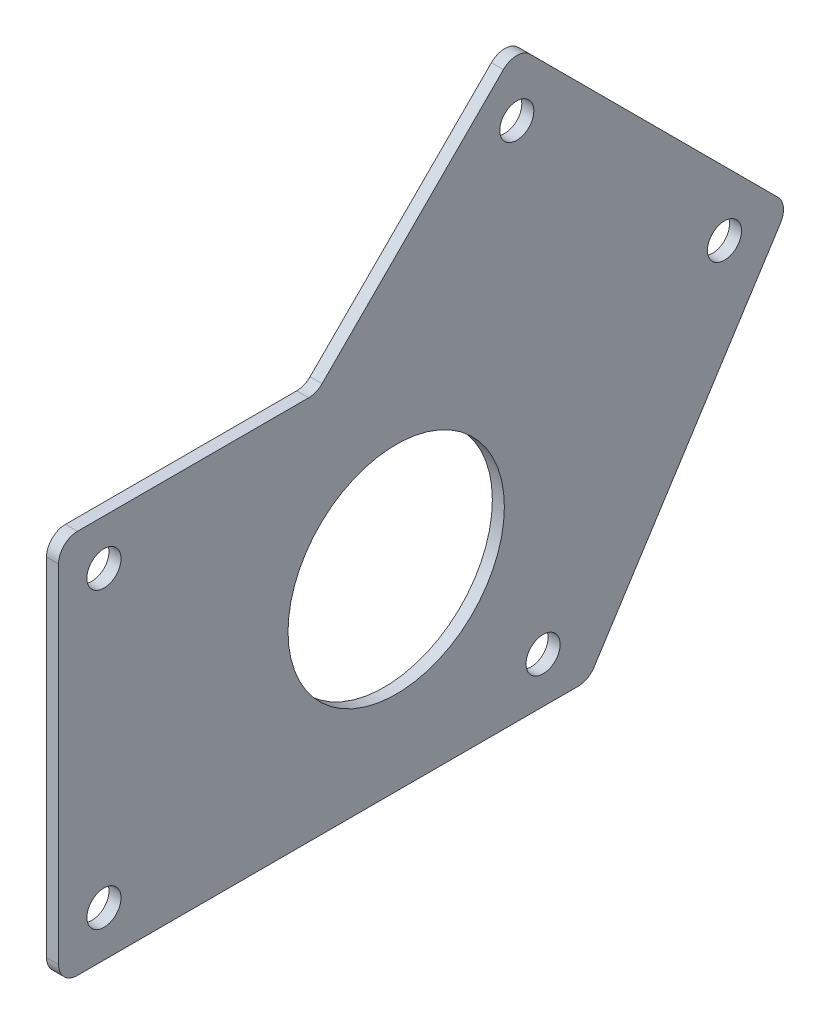
ISO-10303-21;
HEADER;
FILE_DESCRIPTION(('STEP AP214'),'2;1');
FILE_NAME('part.step','',(''),(''),'','','');
FILE_SCHEMA(('AUTOMOTIVE_DESIGN { 1 0 10303 214 1 1 1 1 }'));
ENDSEC;
DATA;
#1=APPLICATION_CONTEXT('core data for automotive mechanical design processes');
#2=APPLICATION_PROTOCOL_DEFINITION('international standard','automotive_design',2000,#1);
#3=PRODUCT_CONTEXT('',#1,'mechanical');
#4=PRODUCT('Part','Part','',(#3));
#5=PRODUCT_RELATED_PRODUCT_CATEGORY('part','',(#4));
#6=PRODUCT_DEFINITION_FORMATION('','',#4);
#7=PRODUCT_DEFINITION_CONTEXT('part definition',#1,'design');
#8=PRODUCT_DEFINITION('design','',#6,#7);
#9=PRODUCT_DEFINITION_SHAPE('','',#8);
#10=(LENGTH_UNIT() NAMED_UNIT(*) SI_UNIT(.MILLI.,.METRE.));
#11=(NAMED_UNIT(*) PLANE_ANGLE_UNIT() SI_UNIT($,.RADIAN.));
#12=(NAMED_UNIT(*) SI_UNIT($,.STERADIAN.) SOLID_ANGLE_UNIT());
#13=UNCERTAINTY_MEASURE_WITH_UNIT(LENGTH_MEASURE(1.E-05),#10,'distance_accuracy_value','');
#14=(GEOMETRIC_REPRESENTATION_CONTEXT(3) GLOBAL_UNCERTAINTY_ASSIGNED_CONTEXT((#13)) GLOBAL_UNIT_ASSIGNED_CONTEXT((#10,
#11,#12)) REPRESENTATION_CONTEXT('',''));
#15=CARTESIAN_POINT('',(0.,0.,0.));
#16=DIRECTION('',(0.,0.,1.));
#17=DIRECTION('',(1.,0.,0.));
#18=AXIS2_PLACEMENT_3D('',#15,#16,#17);
#19=CARTESIAN_POINT('',(103.1875,27.9,-117.643441609791));
#20=DIRECTION('',(-1.,0.,0.));
#21=DIRECTION('',(0.,0.,1.));
#22=AXIS2_PLACEMENT_3D('',#19,#20,#21);
#23=CYLINDRICAL_SURFACE('',#22,2.5);
#24=CARTESIAN_POINT('',(101.6,27.9,-117.643441609791));
#25=DIRECTION('',(1.,0.,0.));
#26=DIRECTION('',(0.,0.,-1.));
#27=AXIS2_PLACEMENT_3D('',#24,#25,#26);
#28=CIRCLE('',#27,2.5);
#29=CARTESIAN_POINT('',(101.6,25.4,-117.643441609791));
#30=VERTEX_POINT('',#29);
#31=CARTESIAN_POINT('',(101.6,26.1322330470337,-119.411208562757));
#32=VERTEX_POINT('',#31);
#33=EDGE_CURVE('E177',#30,#32,#28,.T.);
#34=ORIENTED_EDGE('',*,*,#33,.F.);
#35=DIRECTION('',(-1.,0.,0.));
#36=VECTOR('',#35,1.);
#37=CARTESIAN_POINT('',(103.1875,25.4,-117.643441609791));
#38=LINE('',#37,#36);
#39=CARTESIAN_POINT('',(103.1875,25.4,-117.643441609791));
#40=VERTEX_POINT('',#39);
#41=EDGE_CURVE('E11',#40,#30,#38,.T.);
#42=ORIENTED_EDGE('',*,*,#41,.F.);
#43=CARTESIAN_POINT('',(103.1875,27.9,-117.643441609791));
#44=DIRECTION('',(1.,0.,0.));
#45=DIRECTION('',(0.,0.,-1.));
#46=AXIS2_PLACEMENT_3D('',#43,#44,#45);
#47=CIRCLE('',#46,2.5);
#48=CARTESIAN_POINT('',(103.1875,26.1322330470337,-119.411208562757));
#49=VERTEX_POINT('',#48);
#50=EDGE_CURVE('E226',#40,#49,#47,.T.);
#51=ORIENTED_EDGE('',*,*,#50,.T.);
#52=DIRECTION('',(-1.,0.,0.));
#53=VECTOR('',#52,1.);
#54=CARTESIAN_POINT('',(103.1875,26.1322330470337,-119.411208562757));
#55=LINE('',#54,#53);
#56=EDGE_CURVE('E56',#49,#32,#55,.T.);
#57=ORIENTED_EDGE('',*,*,#56,.T.);
#58=EDGE_LOOP('',(#34,#42,#51,#57));
#59=FACE_BOUND('',#58,.T.);
#60=ADVANCED_FACE('F40',(#59),#23,.F.);
#61=CARTESIAN_POINT('',(103.1875,25.4,0.));
#62=DIRECTION('',(0.,-1.,0.));
#63=DIRECTION('',(0.,0.,-1.));
#64=AXIS2_PLACEMENT_3D('',#61,#62,#63);
#65=PLANE('',#64);
#66=DIRECTION('',(0.,0.,1.));
#67=VECTOR('',#66,1.);
#68=CARTESIAN_POINT('',(101.6,25.4,0.));
#69=LINE('',#68,#67);
#70=CARTESIAN_POINT('',(101.6,25.4,-87.1));
#71=VERTEX_POINT('',#70);
#72=EDGE_CURVE('E179',#30,#71,#69,.T.);
#73=ORIENTED_EDGE('',*,*,#72,.T.);
#74=DIRECTION('',(-1.,0.,0.));
#75=VECTOR('',#74,1.);
#76=CARTESIAN_POINT('',(103.1875,25.4,-87.1));
#77=LINE('',#76,#75);
#78=CARTESIAN_POINT('',(103.1875,25.4,-87.1));
#79=VERTEX_POINT('',#78);
#80=EDGE_CURVE('E48',#79,#71,#77,.T.);
#81=ORIENTED_EDGE('',*,*,#80,.F.);
#82=DIRECTION('',(0.,0.,1.));
#83=VECTOR('',#82,1.);
#84=CARTESIAN_POINT('',(103.1875,25.4,0.));
#85=LINE('',#84,#83);
#86=EDGE_CURVE('E267',#40,#79,#85,.T.);
#87=ORIENTED_EDGE('',*,*,#86,.F.);
#88=ORIENTED_EDGE('',*,*,#41,.T.);
#89=EDGE_LOOP('',(#73,#81,#87,#88));
#90=FACE_BOUND('',#89,.T.);
#91=ADVANCED_FACE('F297',(#90),#65,.F.);
#92=CARTESIAN_POINT('',(103.1875,22.9,-87.1));
#93=DIRECTION('',(-1.,0.,0.));
#94=DIRECTION('',(0.,0.,1.));
#95=AXIS2_PLACEMENT_3D('',#92,#93,#94);
#96=CYLINDRICAL_SURFACE('',#95,2.5);
#97=CARTESIAN_POINT('',(101.6,22.9,-87.1));
#98=DIRECTION('',(1.,0.,0.));
#99=DIRECTION('',(0.,0.,-1.));
#100=AXIS2_PLACEMENT_3D('',#97,#98,#99);
#101=CIRCLE('',#100,2.5);
#102=CARTESIAN_POINT('',(101.6,22.9,-84.6));
#103=VERTEX_POINT('',#102);
#104=EDGE_CURVE('E181',#71,#103,#101,.T.);
#105=ORIENTED_EDGE('',*,*,#104,.T.);
#106=DIRECTION('',(-1.,0.,0.));
#107=VECTOR('',#106,1.);
#108=CARTESIAN_POINT('',(103.1875,22.9,-84.6));
#109=LINE('',#108,#107);
#110=CARTESIAN_POINT('',(103.1875,22.9,-84.6));
#111=VERTEX_POINT('',#110);
#112=EDGE_CURVE('E240',#111,#103,#109,.T.);
#113=ORIENTED_EDGE('',*,*,#112,.F.);
#114=CARTESIAN_POINT('',(103.1875,22.9,-87.1));
#115=DIRECTION('',(1.,0.,0.));
#116=DIRECTION('',(0.,0.,-1.));
#117=AXIS2_PLACEMENT_3D('',#114,#115,#116);
#118=CIRCLE('',#117,2.5);
#119=EDGE_CURVE('E248',#79,#111,#118,.T.);
#120=ORIENTED_EDGE('',*,*,#119,.F.);
#121=ORIENTED_EDGE('',*,*,#80,.T.);
#122=EDGE_LOOP('',(#105,#113,#120,#121));
#123=FACE_BOUND('',#122,.T.);
#124=ADVANCED_FACE('F246',(#123),#96,.T.);
#125=CARTESIAN_POINT('',(103.1875,0.,-84.6));
#126=DIRECTION('',(0.,0.,1.));
#127=DIRECTION('',(1.,0.,0.));
#128=AXIS2_PLACEMENT_3D('',#125,#126,#127);
#129=PLANE('',#128);
#130=DIRECTION('',(0.,1.,0.));
#131=VECTOR('',#130,1.);
#132=CARTESIAN_POINT('',(101.6,0.,-84.6));
#133=LINE('',#132,#131);
#134=CARTESIAN_POINT('',(101.6,-22.9,-84.6));
#135=VERTEX_POINT('',#134);
#136=EDGE_CURVE('E184',#135,#103,#133,.T.);
#137=ORIENTED_EDGE('',*,*,#136,.F.);
#138=DIRECTION('',(-1.,0.,0.));
#139=VECTOR('',#138,1.);
#140=CARTESIAN_POINT('',(103.1875,-22.9,-84.6));
#141=LINE('',#140,#139);
#142=CARTESIAN_POINT('',(103.1875,-22.9,-84.6));
#143=VERTEX_POINT('',#142);
#144=EDGE_CURVE('E238',#143,#135,#141,.T.);
#145=ORIENTED_EDGE('',*,*,#144,.F.);
#146=DIRECTION('',(0.,1.,0.));
#147=VECTOR('',#146,1.);
#148=CARTESIAN_POINT('',(103.1875,0.,-84.6));
#149=LINE('',#148,#147);
#150=EDGE_CURVE('E260',#143,#111,#149,.T.);
#151=ORIENTED_EDGE('',*,*,#150,.T.);
#152=ORIENTED_EDGE('',*,*,#112,.T.);
#153=EDGE_LOOP('',(#137,#145,#151,#152));
#154=FACE_BOUND('',#153,.T.);
#155=ADVANCED_FACE('F257',(#154),#129,.T.);
#156=CARTESIAN_POINT('',(103.1875,-22.9,-87.1));
#157=DIRECTION('',(-1.,0.,0.));
#158=DIRECTION('',(0.,0.,1.));
#159=AXIS2_PLACEMENT_3D('',#156,#157,#158);
#160=CYLINDRICAL_SURFACE('',#159,2.5);
#161=CARTESIAN_POINT('',(101.6,-22.9,-87.1));
#162=DIRECTION('',(1.,0.,0.));
#163=DIRECTION('',(0.,0.,-1.));
#164=AXIS2_PLACEMENT_3D('',#161,#162,#163);
#165=CIRCLE('',#164,2.5);
#166=CARTESIAN_POINT('',(101.6,-25.4,-87.1));
#167=VERTEX_POINT('',#166);
#168=EDGE_CURVE('E187',#167,#135,#165,.F.);
#169=ORIENTED_EDGE('',*,*,#168,.F.);
#170=DIRECTION('',(-1.,0.,0.));
#171=VECTOR('',#170,1.);
#172=CARTESIAN_POINT('',(103.1875,-25.4,-87.1));
#173=LINE('',#172,#171);
#174=CARTESIAN_POINT('',(103.1875,-25.4,-87.1));
#175=VERTEX_POINT('',#174);
#176=EDGE_CURVE('E236',#175,#167,#173,.T.);
#177=ORIENTED_EDGE('',*,*,#176,.F.);
#178=CARTESIAN_POINT('',(103.1875,-22.9,-87.1));
#179=DIRECTION('',(1.,0.,0.));
#180=DIRECTION('',(0.,0.,-1.));
#181=AXIS2_PLACEMENT_3D('',#178,#179,#180);
#182=CIRCLE('',#181,2.5);
#183=EDGE_CURVE('E263',#175,#143,#182,.F.);
#184=ORIENTED_EDGE('',*,*,#183,.T.);
#185=ORIENTED_EDGE('',*,*,#144,.T.);
#186=EDGE_LOOP('',(#169,#177,#184,#185));
#187=FACE_BOUND('',#186,.T.);
#188=ADVANCED_FACE('F308',(#187),#160,.T.);
#189=CARTESIAN_POINT('',(103.1875,-25.4,0.));
#190=DIRECTION('',(0.,-1.,0.));
#191=DIRECTION('',(0.,0.,-1.));
#192=AXIS2_PLACEMENT_3D('',#189,#190,#191);
#193=PLANE('',#192);
#194=DIRECTION('',(0.,0.,1.));
#195=VECTOR('',#194,1.);
#196=CARTESIAN_POINT('',(101.6,-25.4,0.));
#197=LINE('',#196,#195);
#198=CARTESIAN_POINT('',(101.6,-25.4,-153.231778176145));
#199=VERTEX_POINT('',#198);
#200=EDGE_CURVE('E190',#199,#167,#197,.T.);
#201=ORIENTED_EDGE('',*,*,#200,.F.);
#202=DIRECTION('',(-1.,0.,0.));
#203=VECTOR('',#202,1.);
#204=CARTESIAN_POINT('',(103.1875,-25.4,-153.231778176145));
#205=LINE('',#204,#203);
#206=CARTESIAN_POINT('',(103.1875,-25.4,-153.231778176145));
#207=VERTEX_POINT('',#206);
#208=EDGE_CURVE('E234',#207,#199,#205,.T.);
#209=ORIENTED_EDGE('',*,*,#208,.F.);
#210=DIRECTION('',(0.,0.,1.));
#211=VECTOR('',#210,1.);
#212=CARTESIAN_POINT('',(103.1875,-25.4,0.));
#213=LINE('',#212,#211);
#214=EDGE_CURVE('E265',#207,#175,#213,.T.);
#215=ORIENTED_EDGE('',*,*,#214,.T.);
#216=ORIENTED_EDGE('',*,*,#176,.T.);
#217=EDGE_LOOP('',(#201,#209,#215,#216));
#218=FACE_BOUND('',#217,.T.);
#219=ADVANCED_FACE('F311',(#218),#193,.T.);
#220=CARTESIAN_POINT('',(103.1875,-22.9,-153.231778176145));
#221=DIRECTION('',(-1.,0.,0.));
#222=DIRECTION('',(0.,0.,1.));
#223=AXIS2_PLACEMENT_3D('',#220,#221,#222);
#224=CYLINDRICAL_SURFACE('',#223,2.5);
#225=CARTESIAN_POINT('',(101.6,-22.9,-153.231778176145));
#226=DIRECTION('',(1.,0.,0.));
#227=DIRECTION('',(0.,0.,-1.));
#228=AXIS2_PLACEMENT_3D('',#225,#226,#227);
#229=CIRCLE('',#228,2.5);
#230=CARTESIAN_POINT('',(101.6,-24.2475598229923,-155.337504303507));
#231=VERTEX_POINT('',#230);
#232=EDGE_CURVE('E193',#199,#231,#229,.T.);
#233=ORIENTED_EDGE('',*,*,#232,.T.);
#234=DIRECTION('',(-1.,0.,0.));
#235=VECTOR('',#234,1.);
#236=CARTESIAN_POINT('',(103.1875,-24.2475598229923,-155.337504303507));
#237=LINE('',#236,#235);
#238=CARTESIAN_POINT('',(103.1875,-24.2475598229923,-155.337504303507));
#239=VERTEX_POINT('',#238);
#240=EDGE_CURVE('E232',#239,#231,#237,.T.);
#241=ORIENTED_EDGE('',*,*,#240,.F.);
#242=CARTESIAN_POINT('',(103.1875,-22.9,-153.231778176145));
#243=DIRECTION('',(1.,0.,0.));
#244=DIRECTION('',(0.,0.,-1.));
#245=AXIS2_PLACEMENT_3D('',#242,#243,#244);
#246=CIRCLE('',#245,2.5);
#247=EDGE_CURVE('E273',#207,#239,#246,.T.);
#248=ORIENTED_EDGE('',*,*,#247,.F.);
#249=ORIENTED_EDGE('',*,*,#208,.T.);
#250=EDGE_LOOP('',(#233,#241,#248,#249));
#251=FACE_BOUND('',#250,.T.);
#252=ADVANCED_FACE('F315',(#251),#224,.T.);
#253=CARTESIAN_POINT('',(103.1875,-77.5705625422909,-121.213438893427));
#254=DIRECTION('',(0.,-0.539023929196903,-0.842290450945));
#255=DIRECTION('',(0.,0.842290450945,-0.539023929196903));
#256=AXIS2_PLACEMENT_3D('',#253,#254,#255);
#257=PLANE('',#256);
#258=DIRECTION('',(0.,-0.842290450945,0.539023929196903));
#259=VECTOR('',#258,1.);
#260=CARTESIAN_POINT('',(101.6,-77.5705625422909,-121.213438893427));
#261=LINE('',#260,#259);
#262=CARTESIAN_POINT('',(101.6,14.2312008588714,-179.961994288043));
#263=VERTEX_POINT('',#262);
#264=EDGE_CURVE('E196',#263,#231,#261,.T.);
#265=ORIENTED_EDGE('',*,*,#264,.F.);
#266=DIRECTION('',(-1.,0.,0.));
#267=VECTOR('',#266,1.);
#268=CARTESIAN_POINT('',(103.1875,14.2312008588714,-179.961994288043));
#269=LINE('',#268,#267);
#270=CARTESIAN_POINT('',(103.1875,14.2312008588714,-179.961994288043));
#271=VERTEX_POINT('',#270);
#272=EDGE_CURVE('E230',#271,#263,#269,.T.);
#273=ORIENTED_EDGE('',*,*,#272,.F.);
#274=DIRECTION('',(0.,-0.842290450945,0.539023929196903));
#275=VECTOR('',#274,1.);
#276=CARTESIAN_POINT('',(103.1875,-77.5705625422909,-121.213438893427));
#277=LINE('',#276,#275);
#278=EDGE_CURVE('E275',#271,#239,#277,.T.);
#279=ORIENTED_EDGE('',*,*,#278,.T.);
#280=ORIENTED_EDGE('',*,*,#240,.T.);
#281=EDGE_LOOP('',(#265,#273,#279,#280));
#282=FACE_BOUND('',#281,.T.);
#283=ADVANCED_FACE('F319',(#282),#257,.T.);
#284=CARTESIAN_POINT('',(103.1875,15.5787606818636,-177.856268160681));
#285=DIRECTION('',(-1.,0.,0.));
#286=DIRECTION('',(0.,0.,1.));
#287=AXIS2_PLACEMENT_3D('',#284,#285,#286);
#288=CYLINDRICAL_SURFACE('',#287,2.49999999999999);
#289=CARTESIAN_POINT('',(101.6,15.5787606818636,-177.856268160681));
#290=DIRECTION('',(1.,0.,0.));
#291=DIRECTION('',(0.,0.,-1.));
#292=AXIS2_PLACEMENT_3D('',#289,#290,#291);
#293=CIRCLE('',#292,2.49999999999999);
#294=CARTESIAN_POINT('',(101.6,17.34652763483,-179.624035113647));
#295=VERTEX_POINT('',#294);
#296=EDGE_CURVE('E199',#295,#263,#293,.F.);
#297=ORIENTED_EDGE('',*,*,#296,.F.);
#298=DIRECTION('',(-1.,0.,0.));
#299=VECTOR('',#298,1.);
#300=CARTESIAN_POINT('',(103.1875,17.34652763483,-179.624035113647));
#301=LINE('',#300,#299);
#302=CARTESIAN_POINT('',(103.1875,17.34652763483,-179.624035113647));
#303=VERTEX_POINT('',#302);
#304=EDGE_CURVE('E139',#303,#295,#301,.T.);
#305=ORIENTED_EDGE('',*,*,#304,.F.);
#306=CARTESIAN_POINT('',(103.1875,15.5787606818636,-177.856268160681));
#307=DIRECTION('',(1.,0.,0.));
#308=DIRECTION('',(0.,0.,-1.));
#309=AXIS2_PLACEMENT_3D('',#306,#307,#308);
#310=CIRCLE('',#309,2.49999999999999);
#311=EDGE_CURVE('E151',#303,#271,#310,.F.);
#312=ORIENTED_EDGE('',*,*,#311,.T.);
#313=ORIENTED_EDGE('',*,*,#272,.T.);
#314=EDGE_LOOP('',(#297,#305,#312,#313));
#315=FACE_BOUND('',#314,.T.);
#316=ADVANCED_FACE('F279',(#315),#288,.T.);
#317=CARTESIAN_POINT('',(103.1875,98.4852813742386,-98.4852813742386));
#318=DIRECTION('',(0.,0.707106781186548,-0.707106781186547));
#319=DIRECTION('',(0.,0.707106781186547,0.707106781186548));
#320=AXIS2_PLACEMENT_3D('',#317,#318,#319);
#321=PLANE('',#320);
#322=DIRECTION('',(0.,-0.707106781186547,-0.707106781186548));
#323=VECTOR('',#322,1.);
#324=CARTESIAN_POINT('',(101.6,98.4852813742386,-98.4852813742386));
#325=LINE('',#324,#323);
#326=CARTESIAN_POINT('',(101.6,50.0780266634105,-146.892536085067));
#327=VERTEX_POINT('',#326);
#328=EDGE_CURVE('E135',#327,#295,#325,.T.);
#329=ORIENTED_EDGE('',*,*,#328,.F.);
#330=DIRECTION('',(-1.,0.,0.));
#331=VECTOR('',#330,1.);
#332=CARTESIAN_POINT('',(103.1875,50.0780266634105,-146.892536085067));
#333=LINE('',#332,#331);
#334=CARTESIAN_POINT('',(103.1875,50.0780266634105,-146.892536085067));
#335=VERTEX_POINT('',#334);
#336=EDGE_CURVE('E130',#335,#327,#333,.T.);
#337=ORIENTED_EDGE('',*,*,#336,.F.);
#338=DIRECTION('',(0.,-0.707106781186547,-0.707106781186548));
#339=VECTOR('',#338,1.);
#340=CARTESIAN_POINT('',(103.1875,98.4852813742386,-98.4852813742386));
#341=LINE('',#340,#339);
#342=EDGE_CURVE('E133',#335,#303,#341,.T.);
#343=ORIENTED_EDGE('',*,*,#342,.T.);
#344=ORIENTED_EDGE('',*,*,#304,.T.);
#345=EDGE_LOOP('',(#329,#337,#343,#344));
#346=FACE_BOUND('',#345,.T.);
#347=ADVANCED_FACE('F132',(#346),#321,.T.);
#348=CARTESIAN_POINT('',(103.1875,48.3102597104441,-145.1247691321));
#349=DIRECTION('',(-1.,0.,0.));
#350=DIRECTION('',(0.,0.,1.));
#351=AXIS2_PLACEMENT_3D('',#348,#349,#350);
#352=CYLINDRICAL_SURFACE('',#351,2.5);
#353=CARTESIAN_POINT('',(101.6,48.3102597104441,-145.1247691321));
#354=DIRECTION('',(1.,0.,0.));
#355=DIRECTION('',(0.,0.,-1.));
#356=AXIS2_PLACEMENT_3D('',#353,#354,#355);
#357=CIRCLE('',#356,2.5);
#358=CARTESIAN_POINT('',(101.6,50.0780266634105,-143.357002179134));
#359=VERTEX_POINT('',#358);
#360=EDGE_CURVE('E203',#359,#327,#357,.F.);
#361=ORIENTED_EDGE('',*,*,#360,.F.);
#362=DIRECTION('',(-1.,0.,0.));
#363=VECTOR('',#362,1.);
#364=CARTESIAN_POINT('',(103.1875,50.0780266634105,-143.357002179134));
#365=LINE('',#364,#363);
#366=CARTESIAN_POINT('',(103.1875,50.0780266634105,-143.357002179134));
#367=VERTEX_POINT('',#366);
#368=EDGE_CURVE('E93',#367,#359,#365,.T.);
#369=ORIENTED_EDGE('',*,*,#368,.F.);
#370=CARTESIAN_POINT('',(103.1875,48.3102597104441,-145.1247691321));
#371=DIRECTION('',(1.,0.,0.));
#372=DIRECTION('',(0.,0.,-1.));
#373=AXIS2_PLACEMENT_3D('',#370,#371,#372);
#374=CIRCLE('',#373,2.5);
#375=EDGE_CURVE('E148',#367,#335,#374,.F.);
#376=ORIENTED_EDGE('',*,*,#375,.T.);
#377=ORIENTED_EDGE('',*,*,#336,.T.);
#378=EDGE_LOOP('',(#361,#369,#376,#377));
#379=FACE_BOUND('',#378,.T.);
#380=ADVANCED_FACE('F153',(#379),#352,.T.);
#381=CARTESIAN_POINT('',(103.1875,-19.4,-90.6));
#382=DIRECTION('',(-1.,0.,0.));
#383=DIRECTION('',(0.,0.,1.));
#384=AXIS2_PLACEMENT_3D('',#381,#382,#383);
#385=CYLINDRICAL_SURFACE('',#384,2.25);
#386=CARTESIAN_POINT('',(103.1875,-19.4,-90.6));
#387=DIRECTION('',(1.,0.,0.));
#388=DIRECTION('',(0.,0.,-1.));
#389=AXIS2_PLACEMENT_3D('',#386,#387,#388);
#390=CIRCLE('',#389,2.25);
#391=CARTESIAN_POINT('',(103.1875,-19.4,-92.85));
#392=VERTEX_POINT('',#391);
#393=EDGE_CURVE('E171',#392,#392,#390,.T.);
#394=ORIENTED_EDGE('',*,*,#393,.T.);
#395=EDGE_LOOP('',(#394));
#396=FACE_BOUND('',#395,.T.);
#397=CARTESIAN_POINT('',(101.6,-19.4,-90.6));
#398=DIRECTION('',(1.,0.,0.));
#399=DIRECTION('',(0.,0.,-1.));
#400=AXIS2_PLACEMENT_3D('',#397,#398,#399);
#401=CIRCLE('',#400,2.25);
#402=CARTESIAN_POINT('',(101.6,-19.4,-92.85));
#403=VERTEX_POINT('',#402);
#404=EDGE_CURVE('E220',#403,#403,#401,.T.);
#405=ORIENTED_EDGE('',*,*,#404,.F.);
#406=EDGE_LOOP('',(#405));
#407=FACE_BOUND('',#406,.T.);
#408=ADVANCED_FACE('F328',(#396,#407),#385,.F.);
#409=CARTESIAN_POINT('',(103.1875,-19.4,-148.6));
#410=DIRECTION('',(-1.,0.,0.));
#411=DIRECTION('',(0.,0.,1.));
#412=AXIS2_PLACEMENT_3D('',#409,#410,#411);
#413=CYLINDRICAL_SURFACE('',#412,2.25000000000001);
#414=CARTESIAN_POINT('',(103.1875,-19.4,-148.6));
#415=DIRECTION('',(1.,0.,0.));
#416=DIRECTION('',(0.,0.,-1.));
#417=AXIS2_PLACEMENT_3D('',#414,#415,#416);
#418=CIRCLE('',#417,2.25000000000001);
#419=CARTESIAN_POINT('',(103.1875,-19.4,-150.85));
#420=VERTEX_POINT('',#419);
#421=EDGE_CURVE('E168',#420,#420,#418,.T.);
#422=ORIENTED_EDGE('',*,*,#421,.T.);
#423=EDGE_LOOP('',(#422));
#424=FACE_BOUND('',#423,.T.);
#425=CARTESIAN_POINT('',(101.6,-19.4,-148.6));
#426=DIRECTION('',(1.,0.,0.));
#427=DIRECTION('',(0.,0.,-1.));
#428=AXIS2_PLACEMENT_3D('',#425,#426,#427);
#429=CIRCLE('',#428,2.25000000000001);
#430=CARTESIAN_POINT('',(101.6,-19.4,-150.85));
#431=VERTEX_POINT('',#430);
#432=EDGE_CURVE('E217',#431,#431,#429,.T.);
#433=ORIENTED_EDGE('',*,*,#432,.F.);
#434=EDGE_LOOP('',(#433));
#435=FACE_BOUND('',#434,.T.);
#436=ADVANCED_FACE('F332',(#424,#435),#413,.F.);
#437=CARTESIAN_POINT('',(103.1875,15.924769132098,-172.560512242141));
#438=DIRECTION('',(-1.,0.,0.));
#439=DIRECTION('',(0.,0.,1.));
#440=AXIS2_PLACEMENT_3D('',#437,#438,#439);
#441=CYLINDRICAL_SURFACE('',#440,2.25000000000001);
#442=CARTESIAN_POINT('',(103.1875,15.924769132098,-172.560512242141));
#443=DIRECTION('',(1.,0.,0.));
#444=DIRECTION('',(0.,0.,-1.));
#445=AXIS2_PLACEMENT_3D('',#442,#443,#444);
#446=CIRCLE('',#445,2.25000000000001);
#447=CARTESIAN_POINT('',(103.1875,15.924769132098,-174.810512242141));
#448=VERTEX_POINT('',#447);
#449=EDGE_CURVE('E165',#448,#448,#446,.T.);
#450=ORIENTED_EDGE('',*,*,#449,.T.);
#451=EDGE_LOOP('',(#450));
#452=FACE_BOUND('',#451,.T.);
#453=CARTESIAN_POINT('',(101.6,15.924769132098,-172.560512242141));
#454=DIRECTION('',(1.,0.,0.));
#455=DIRECTION('',(0.,0.,-1.));
#456=AXIS2_PLACEMENT_3D('',#453,#454,#455);
#457=CIRCLE('',#456,2.25000000000001);
#458=CARTESIAN_POINT('',(101.6,15.924769132098,-174.810512242141));
#459=VERTEX_POINT('',#458);
#460=EDGE_CURVE('E214',#459,#459,#457,.T.);
#461=ORIENTED_EDGE('',*,*,#460,.F.);
#462=EDGE_LOOP('',(#461));
#463=FACE_BOUND('',#462,.T.);
#464=ADVANCED_FACE('F338',(#452,#463),#441,.F.);
#465=CARTESIAN_POINT('',(103.1875,43.3605122421383,-145.1247691321));
#466=DIRECTION('',(-1.,0.,0.));
#467=DIRECTION('',(0.,0.,1.));
#468=AXIS2_PLACEMENT_3D('',#465,#466,#467);
#469=CYLINDRICAL_SURFACE('',#468,2.25000000000001);
#470=CARTESIAN_POINT('',(103.1875,43.3605122421383,-145.1247691321));
#471=DIRECTION('',(1.,0.,0.));
#472=DIRECTION('',(0.,0.,-1.));
#473=AXIS2_PLACEMENT_3D('',#470,#471,#472);
#474=CIRCLE('',#473,2.25000000000001);
#475=CARTESIAN_POINT('',(103.1875,43.3605122421383,-147.3747691321));
#476=VERTEX_POINT('',#475);
#477=EDGE_CURVE('E162',#476,#476,#474,.T.);
#478=ORIENTED_EDGE('',*,*,#477,.T.);
#479=EDGE_LOOP('',(#478));
#480=FACE_BOUND('',#479,.T.);
#481=CARTESIAN_POINT('',(101.6,43.3605122421383,-145.1247691321));
#482=DIRECTION('',(1.,0.,0.));
#483=DIRECTION('',(0.,0.,-1.));
#484=AXIS2_PLACEMENT_3D('',#481,#482,#483);
#485=CIRCLE('',#484,2.25000000000001);
#486=CARTESIAN_POINT('',(101.6,43.3605122421383,-147.3747691321));
#487=VERTEX_POINT('',#486);
#488=EDGE_CURVE('E211',#487,#487,#485,.T.);
#489=ORIENTED_EDGE('',*,*,#488,.F.);
#490=EDGE_LOOP('',(#489));
#491=FACE_BOUND('',#490,.T.);
#492=ADVANCED_FACE('F292',(#480,#491),#469,.F.);
#493=CARTESIAN_POINT('',(103.1875,0.,-129.2));
#494=DIRECTION('',(-1.,0.,0.));
#495=DIRECTION('',(0.,0.,1.));
#496=AXIS2_PLACEMENT_3D('',#493,#494,#495);
#497=CYLINDRICAL_SURFACE('',#496,14.2875);
#498=CARTESIAN_POINT('',(103.1875,0.,-129.2));
#499=DIRECTION('',(1.,0.,0.));
#500=DIRECTION('',(0.,0.,-1.));
#501=AXIS2_PLACEMENT_3D('',#498,#499,#500);
#502=CIRCLE('',#501,14.2875);
#503=CARTESIAN_POINT('',(103.1875,0.,-143.4875));
#504=VERTEX_POINT('',#503);
#505=EDGE_CURVE('E156',#504,#504,#502,.T.);
#506=ORIENTED_EDGE('',*,*,#505,.T.);
#507=EDGE_LOOP('',(#506));
#508=FACE_BOUND('',#507,.T.);
#509=CARTESIAN_POINT('',(101.6,0.,-129.2));
#510=DIRECTION('',(1.,0.,0.));
#511=DIRECTION('',(0.,0.,-1.));
#512=AXIS2_PLACEMENT_3D('',#509,#510,#511);
#513=CIRCLE('',#512,14.2875);
#514=CARTESIAN_POINT('',(101.6,0.,-143.4875));
#515=VERTEX_POINT('',#514);
#516=EDGE_CURVE('E208',#515,#515,#513,.T.);
#517=ORIENTED_EDGE('',*,*,#516,.F.);
#518=EDGE_LOOP('',(#517));
#519=FACE_BOUND('',#518,.T.);
#520=ADVANCED_FACE('F284',(#508,#519),#497,.F.);
#521=CARTESIAN_POINT('',(103.1875,-46.6394877578617,-46.6394877578617));
#522=DIRECTION('',(0.,0.707106781186548,0.707106781186547));
#523=DIRECTION('',(0.,-0.707106781186547,0.707106781186548));
#524=AXIS2_PLACEMENT_3D('',#521,#522,#523);
#525=PLANE('',#524);
#526=DIRECTION('',(0.,0.707106781186547,-0.707106781186548));
#527=VECTOR('',#526,1.);
#528=CARTESIAN_POINT('',(101.6,-46.6394877578617,-46.6394877578617));
#529=LINE('',#528,#527);
#530=EDGE_CURVE('E205',#32,#359,#529,.T.);
#531=ORIENTED_EDGE('',*,*,#530,.F.);
#532=ORIENTED_EDGE('',*,*,#56,.F.);
#533=DIRECTION('',(0.,0.707106781186547,-0.707106781186548));
#534=VECTOR('',#533,1.);
#535=CARTESIAN_POINT('',(103.1875,-46.6394877578617,-46.6394877578617));
#536=LINE('',#535,#534);
#537=EDGE_CURVE('E154',#49,#367,#536,.T.);
#538=ORIENTED_EDGE('',*,*,#537,.T.);
#539=ORIENTED_EDGE('',*,*,#368,.T.);
#540=EDGE_LOOP('',(#531,#532,#538,#539));
#541=FACE_BOUND('',#540,.T.);
#542=ADVANCED_FACE('F281',(#541),#525,.T.);
#543=CARTESIAN_POINT('',(103.1875,19.4,-90.6));
#544=DIRECTION('',(-1.,0.,0.));
#545=DIRECTION('',(0.,0.,1.));
#546=AXIS2_PLACEMENT_3D('',#543,#544,#545);
#547=CYLINDRICAL_SURFACE('',#546,2.25);
#548=CARTESIAN_POINT('',(103.1875,19.4,-90.6));
#549=DIRECTION('',(1.,0.,0.));
#550=DIRECTION('',(0.,0.,-1.));
#551=AXIS2_PLACEMENT_3D('',#548,#549,#550);
#552=CIRCLE('',#551,2.25);
#553=CARTESIAN_POINT('',(103.1875,19.4,-92.85));
#554=VERTEX_POINT('',#553);
#555=EDGE_CURVE('E174',#554,#554,#552,.T.);
#556=ORIENTED_EDGE('',*,*,#555,.T.);
#557=EDGE_LOOP('',(#556));
#558=FACE_BOUND('',#557,.T.);
#559=CARTESIAN_POINT('',(101.6,19.4,-90.6));
#560=DIRECTION('',(1.,0.,0.));
#561=DIRECTION('',(0.,0.,-1.));
#562=AXIS2_PLACEMENT_3D('',#559,#560,#561);
#563=CIRCLE('',#562,2.25);
#564=CARTESIAN_POINT('',(101.6,19.4,-92.85));
#565=VERTEX_POINT('',#564);
#566=EDGE_CURVE('E223',#565,#565,#563,.T.);
#567=ORIENTED_EDGE('',*,*,#566,.F.);
#568=EDGE_LOOP('',(#567));
#569=FACE_BOUND('',#568,.T.);
#570=ADVANCED_FACE('F283',(#558,#569),#547,.F.);
#571=CARTESIAN_POINT('',(103.1875,0.,0.));
#572=DIRECTION('',(1.,0.,0.));
#573=DIRECTION('',(0.,0.,-1.));
#574=AXIS2_PLACEMENT_3D('',#571,#572,#573);
#575=PLANE('',#574);
#576=ORIENTED_EDGE('',*,*,#50,.F.);
#577=ORIENTED_EDGE('',*,*,#86,.T.);
#578=ORIENTED_EDGE('',*,*,#119,.T.);
#579=ORIENTED_EDGE('',*,*,#150,.F.);
#580=ORIENTED_EDGE('',*,*,#183,.F.);
#581=ORIENTED_EDGE('',*,*,#214,.F.);
#582=ORIENTED_EDGE('',*,*,#247,.T.);
#583=ORIENTED_EDGE('',*,*,#278,.F.);
#584=ORIENTED_EDGE('',*,*,#311,.F.);
#585=ORIENTED_EDGE('',*,*,#342,.F.);
#586=ORIENTED_EDGE('',*,*,#375,.F.);
#587=ORIENTED_EDGE('',*,*,#537,.F.);
#588=EDGE_LOOP('',(#576,#577,#578,#579,#580,#581,#582,#583,#584,#585,#586,#587));
#589=FACE_BOUND('',#588,.T.);
#590=ORIENTED_EDGE('',*,*,#505,.F.);
#591=EDGE_LOOP('',(#590));
#592=FACE_BOUND('',#591,.T.);
#593=ORIENTED_EDGE('',*,*,#477,.F.);
#594=EDGE_LOOP('',(#593));
#595=FACE_BOUND('',#594,.T.);
#596=ORIENTED_EDGE('',*,*,#449,.F.);
#597=EDGE_LOOP('',(#596));
#598=FACE_BOUND('',#597,.T.);
#599=ORIENTED_EDGE('',*,*,#421,.F.);
#600=EDGE_LOOP('',(#599));
#601=FACE_BOUND('',#600,.T.);
#602=ORIENTED_EDGE('',*,*,#393,.F.);
#603=EDGE_LOOP('',(#602));
#604=FACE_BOUND('',#603,.T.);
#605=ORIENTED_EDGE('',*,*,#555,.F.);
#606=EDGE_LOOP('',(#605));
#607=FACE_BOUND('',#606,.T.);
#608=ADVANCED_FACE('F145',(#589,#592,#595,#598,#601,#604,#607),#575,.T.);
#609=CARTESIAN_POINT('',(101.6,0.,0.));
#610=DIRECTION('',(1.,0.,0.));
#611=DIRECTION('',(0.,0.,-1.));
#612=AXIS2_PLACEMENT_3D('',#609,#610,#611);
#613=PLANE('',#612);
#614=ORIENTED_EDGE('',*,*,#33,.T.);
#615=ORIENTED_EDGE('',*,*,#530,.T.);
#616=ORIENTED_EDGE('',*,*,#360,.T.);
#617=ORIENTED_EDGE('',*,*,#328,.T.);
#618=ORIENTED_EDGE('',*,*,#296,.T.);
#619=ORIENTED_EDGE('',*,*,#264,.T.);
#620=ORIENTED_EDGE('',*,*,#232,.F.);
#621=ORIENTED_EDGE('',*,*,#200,.T.);
#622=ORIENTED_EDGE('',*,*,#168,.T.);
#623=ORIENTED_EDGE('',*,*,#136,.T.);
#624=ORIENTED_EDGE('',*,*,#104,.F.);
#625=ORIENTED_EDGE('',*,*,#72,.F.);
#626=EDGE_LOOP('',(#614,#615,#616,#617,#618,#619,#620,#621,#622,#623,#624,#625));
#627=FACE_BOUND('',#626,.T.);
#628=ORIENTED_EDGE('',*,*,#516,.T.);
#629=EDGE_LOOP('',(#628));
#630=FACE_BOUND('',#629,.T.);
#631=ORIENTED_EDGE('',*,*,#488,.T.);
#632=EDGE_LOOP('',(#631));
#633=FACE_BOUND('',#632,.T.);
#634=ORIENTED_EDGE('',*,*,#460,.T.);
#635=EDGE_LOOP('',(#634));
#636=FACE_BOUND('',#635,.T.);
#637=ORIENTED_EDGE('',*,*,#432,.T.);
#638=EDGE_LOOP('',(#637));
#639=FACE_BOUND('',#638,.T.);
#640=ORIENTED_EDGE('',*,*,#404,.T.);
#641=EDGE_LOOP('',(#640));
#642=FACE_BOUND('',#641,.T.);
#643=ORIENTED_EDGE('',*,*,#566,.T.);
#644=EDGE_LOOP('',(#643));
#645=FACE_BOUND('',#644,.T.);
#646=ADVANCED_FACE('F252',(#627,#630,#633,#636,#639,#642,#645),#613,.F.);
#647=CLOSED_SHELL('',(#60,#91,#124,#155,#188,#219,#252,#283,#316,#347,#380,#408,#436,#464,#492,
#520,#542,#570,#608,#646));
#648=MANIFOLD_SOLID_BREP('B2',#647);
#649=ADVANCED_BREP_SHAPE_REPRESENTATION('',(#18,#648),#14);
#650=SHAPE_DEFINITION_REPRESENTATION(#9,#649);
ENDSEC;
END-ISO-10303-21;
